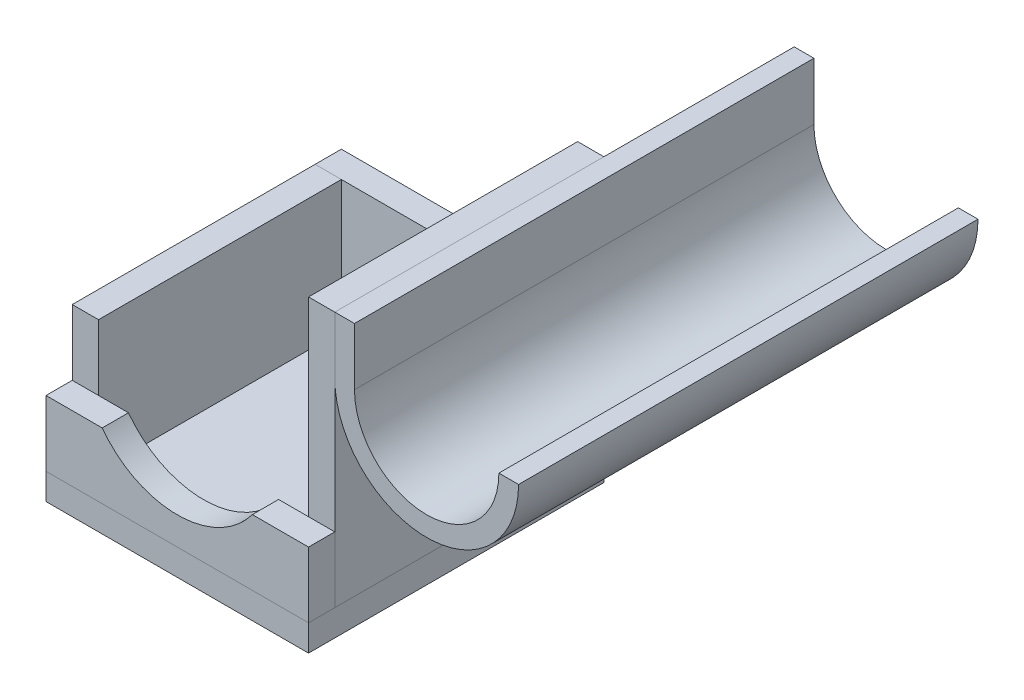
ISO-10303-21;
HEADER;
FILE_DESCRIPTION(('STEP AP214'),'2;1');
FILE_NAME('part.step','',(''),(''),'','','');
FILE_SCHEMA(('AUTOMOTIVE_DESIGN { 1 0 10303 214 1 1 1 1 }'));
ENDSEC;
DATA;
#1=APPLICATION_CONTEXT('core data for automotive mechanical design processes');
#2=APPLICATION_PROTOCOL_DEFINITION('international standard','automotive_design',2000,#1);
#3=PRODUCT_CONTEXT('',#1,'mechanical');
#4=PRODUCT('Part','Part','',(#3));
#5=PRODUCT_RELATED_PRODUCT_CATEGORY('part','',(#4));
#6=PRODUCT_DEFINITION_FORMATION('','',#4);
#7=PRODUCT_DEFINITION_CONTEXT('part definition',#1,'design');
#8=PRODUCT_DEFINITION('design','',#6,#7);
#9=PRODUCT_DEFINITION_SHAPE('','',#8);
#10=(LENGTH_UNIT() NAMED_UNIT(*) SI_UNIT(.MILLI.,.METRE.));
#11=(NAMED_UNIT(*) PLANE_ANGLE_UNIT() SI_UNIT($,.RADIAN.));
#12=(NAMED_UNIT(*) SI_UNIT($,.STERADIAN.) SOLID_ANGLE_UNIT());
#13=UNCERTAINTY_MEASURE_WITH_UNIT(LENGTH_MEASURE(1.E-05),#10,'distance_accuracy_value','');
#14=(GEOMETRIC_REPRESENTATION_CONTEXT(3) GLOBAL_UNCERTAINTY_ASSIGNED_CONTEXT((#13)) GLOBAL_UNIT_ASSIGNED_CONTEXT((#10,
#11,#12)) REPRESENTATION_CONTEXT('',''));
#15=CARTESIAN_POINT('',(0.,0.,0.));
#16=DIRECTION('',(0.,0.,1.));
#17=DIRECTION('',(1.,0.,0.));
#18=AXIS2_PLACEMENT_3D('',#15,#16,#17);
#19=CARTESIAN_POINT('',(54.0453432322365,46.4163242911228,57.6635956434258));
#20=DIRECTION('',(0.,0.,-1.));
#21=DIRECTION('',(-1.,0.,0.));
#22=AXIS2_PLACEMENT_3D('',#19,#20,#21);
#23=CYLINDRICAL_SURFACE('',#22,14.);
#24=CARTESIAN_POINT('',(54.0453432322365,46.4163242911228,57.6635956434258));
#25=DIRECTION('',(0.,0.,1.));
#26=DIRECTION('',(1.,0.,0.));
#27=AXIS2_PLACEMENT_3D('',#24,#25,#26);
#28=CIRCLE('',#27,14.);
#29=CARTESIAN_POINT('',(40.0453432322365,46.4163242911228,57.6635956434258));
#30=VERTEX_POINT('',#29);
#31=CARTESIAN_POINT('',(68.0453432322365,46.4163242911228,57.6635956434258));
#32=VERTEX_POINT('',#31);
#33=EDGE_CURVE('P0_E112',#30,#32,#28,.T.);
#34=ORIENTED_EDGE('',*,*,#33,.F.);
#35=DIRECTION('',(0.,0.,-1.));
#36=VECTOR('',#35,1.);
#37=CARTESIAN_POINT('',(40.0453432322365,46.4163242911228,57.6635956434258));
#38=LINE('',#37,#36);
#39=CARTESIAN_POINT('',(40.0453432322365,46.4163242911228,-12.3364043565742));
#40=VERTEX_POINT('',#39);
#41=EDGE_CURVE('P0_E104',#30,#40,#38,.T.);
#42=ORIENTED_EDGE('',*,*,#41,.T.);
#43=CARTESIAN_POINT('',(54.0453432322365,46.4163242911228,-12.3364043565742));
#44=DIRECTION('',(0.,0.,1.));
#45=DIRECTION('',(1.,0.,0.));
#46=AXIS2_PLACEMENT_3D('',#43,#44,#45);
#47=CIRCLE('',#46,14.);
#48=CARTESIAN_POINT('',(68.0453432322365,46.4163242911228,-12.3364043565742));
#49=VERTEX_POINT('',#48);
#50=EDGE_CURVE('P0_E87',#40,#49,#47,.T.);
#51=ORIENTED_EDGE('',*,*,#50,.T.);
#52=DIRECTION('',(0.,0.,-1.));
#53=VECTOR('',#52,1.);
#54=CARTESIAN_POINT('',(68.0453432322365,46.4163242911228,57.6635956434258));
#55=LINE('',#54,#53);
#56=EDGE_CURVE('P0_E34',#49,#32,#55,.F.);
#57=ORIENTED_EDGE('',*,*,#56,.T.);
#58=EDGE_LOOP('',(#34,#42,#51,#57));
#59=FACE_BOUND('',#58,.T.);
#60=ADVANCED_FACE('P0_F16',(#59),#23,.T.);
#61=CARTESIAN_POINT('',(54.0453432322365,46.4163242911228,57.6635956434258));
#62=DIRECTION('',(0.,0.,1.));
#63=DIRECTION('',(1.,0.,0.));
#64=AXIS2_PLACEMENT_3D('',#61,#62,#63);
#65=PLANE('',#64);
#66=CARTESIAN_POINT('',(54.0453432322365,46.4163242911228,57.6635956434258));
#67=DIRECTION('',(0.,0.,1.));
#68=DIRECTION('',(1.,0.,0.));
#69=AXIS2_PLACEMENT_3D('',#66,#67,#68);
#70=CIRCLE('',#69,11.);
#71=CARTESIAN_POINT('',(43.0453432322365,46.4163242911228,57.6635956434258));
#72=VERTEX_POINT('',#71);
#73=CARTESIAN_POINT('',(65.0453432322365,46.4163242911228,57.6635956434258));
#74=VERTEX_POINT('',#73);
#75=EDGE_CURVE('P0_E106',#72,#74,#70,.T.);
#76=ORIENTED_EDGE('',*,*,#75,.F.);
#77=DIRECTION('',(0.,1.,0.));
#78=VECTOR('',#77,1.);
#79=CARTESIAN_POINT('',(43.0453432322365,46.4163242911228,57.6635956434258));
#80=LINE('',#79,#78);
#81=CARTESIAN_POINT('',(43.0453432322365,55.1570933663999,57.6635956434258));
#82=VERTEX_POINT('',#81);
#83=EDGE_CURVE('P0_E90',#72,#82,#80,.T.);
#84=ORIENTED_EDGE('',*,*,#83,.T.);
#85=DIRECTION('',(-1.,0.,0.));
#86=VECTOR('',#85,1.);
#87=CARTESIAN_POINT('',(43.0453432322365,55.1570933663999,57.6635956434258));
#88=LINE('',#87,#86);
#89=CARTESIAN_POINT('',(40.0453432322365,55.1570933663999,57.6635956434258));
#90=VERTEX_POINT('',#89);
#91=EDGE_CURVE('P0_E96',#82,#90,#88,.T.);
#92=ORIENTED_EDGE('',*,*,#91,.T.);
#93=DIRECTION('',(0.,-1.,0.));
#94=VECTOR('',#93,1.);
#95=CARTESIAN_POINT('',(40.0453432322365,55.1570933663999,57.6635956434258));
#96=LINE('',#95,#94);
#97=EDGE_CURVE('P0_E71',#90,#30,#96,.T.);
#98=ORIENTED_EDGE('',*,*,#97,.T.);
#99=ORIENTED_EDGE('',*,*,#33,.T.);
#100=DIRECTION('',(1.,0.,0.));
#101=VECTOR('',#100,1.);
#102=CARTESIAN_POINT('',(38.0159749624971,46.4163242911228,57.6635956434258));
#103=LINE('',#102,#101);
#104=EDGE_CURVE('P0_E99',#74,#32,#103,.T.);
#105=ORIENTED_EDGE('',*,*,#104,.F.);
#106=EDGE_LOOP('',(#76,#84,#92,#98,#99,#105));
#107=FACE_BOUND('',#106,.T.);
#108=ADVANCED_FACE('P0_F123',(#107),#65,.T.);
#109=CARTESIAN_POINT('',(54.0453432322365,46.4163242911228,-12.3364043565742));
#110=DIRECTION('',(0.,0.,1.));
#111=DIRECTION('',(1.,0.,0.));
#112=AXIS2_PLACEMENT_3D('',#109,#110,#111);
#113=PLANE('',#112);
#114=ORIENTED_EDGE('',*,*,#50,.F.);
#115=DIRECTION('',(0.,-1.,0.));
#116=VECTOR('',#115,1.);
#117=CARTESIAN_POINT('',(40.0453432322365,55.1570933663999,-12.3364043565742));
#118=LINE('',#117,#116);
#119=CARTESIAN_POINT('',(40.0453432322365,55.1570933663999,-12.3364043565742));
#120=VERTEX_POINT('',#119);
#121=EDGE_CURVE('P0_E69',#120,#40,#118,.T.);
#122=ORIENTED_EDGE('',*,*,#121,.F.);
#123=DIRECTION('',(-1.,0.,0.));
#124=VECTOR('',#123,1.);
#125=CARTESIAN_POINT('',(43.0453432322365,55.1570933663999,-12.3364043565742));
#126=LINE('',#125,#124);
#127=CARTESIAN_POINT('',(43.0453432322365,55.1570933663999,-12.3364043565742));
#128=VERTEX_POINT('',#127);
#129=EDGE_CURVE('P0_E84',#128,#120,#126,.T.);
#130=ORIENTED_EDGE('',*,*,#129,.F.);
#131=DIRECTION('',(0.,1.,0.));
#132=VECTOR('',#131,1.);
#133=CARTESIAN_POINT('',(43.0453432322365,46.4163242911228,-12.3364043565742));
#134=LINE('',#133,#132);
#135=CARTESIAN_POINT('',(43.0453432322365,46.4163242911228,-12.3364043565742));
#136=VERTEX_POINT('',#135);
#137=EDGE_CURVE('P0_E77',#136,#128,#134,.T.);
#138=ORIENTED_EDGE('',*,*,#137,.F.);
#139=CARTESIAN_POINT('',(54.0453432322365,46.4163242911228,-12.3364043565742));
#140=DIRECTION('',(0.,0.,1.));
#141=DIRECTION('',(1.,0.,0.));
#142=AXIS2_PLACEMENT_3D('',#139,#140,#141);
#143=CIRCLE('',#142,11.);
#144=CARTESIAN_POINT('',(65.0453432322365,46.4163242911228,-12.3364043565742));
#145=VERTEX_POINT('',#144);
#146=EDGE_CURVE('P0_E107',#136,#145,#143,.T.);
#147=ORIENTED_EDGE('',*,*,#146,.T.);
#148=DIRECTION('',(1.,0.,0.));
#149=VECTOR('',#148,1.);
#150=CARTESIAN_POINT('',(38.0159749624971,46.4163242911228,-12.3364043565742));
#151=LINE('',#150,#149);
#152=EDGE_CURVE('P0_E30',#145,#49,#151,.T.);
#153=ORIENTED_EDGE('',*,*,#152,.T.);
#154=EDGE_LOOP('',(#114,#122,#130,#138,#147,#153));
#155=FACE_BOUND('',#154,.T.);
#156=ADVANCED_FACE('P0_F82',(#155),#113,.F.);
#157=CARTESIAN_POINT('',(54.0453432322365,46.4163242911228,-12.3364043565742));
#158=DIRECTION('',(0.,0.,1.));
#159=DIRECTION('',(1.,0.,0.));
#160=AXIS2_PLACEMENT_3D('',#157,#158,#159);
#161=CYLINDRICAL_SURFACE('',#160,11.);
#162=ORIENTED_EDGE('',*,*,#75,.T.);
#163=DIRECTION('',(0.,0.,1.));
#164=VECTOR('',#163,1.);
#165=CARTESIAN_POINT('',(65.0453432322365,46.4163242911228,-12.3364043565742));
#166=LINE('',#165,#164);
#167=EDGE_CURVE('P0_E10',#74,#145,#166,.F.);
#168=ORIENTED_EDGE('',*,*,#167,.T.);
#169=ORIENTED_EDGE('',*,*,#146,.F.);
#170=DIRECTION('',(0.,0.,1.));
#171=VECTOR('',#170,1.);
#172=CARTESIAN_POINT('',(43.0453432322365,46.4163242911228,-12.3364043565742));
#173=LINE('',#172,#171);
#174=EDGE_CURVE('P0_E23',#136,#72,#173,.T.);
#175=ORIENTED_EDGE('',*,*,#174,.T.);
#176=EDGE_LOOP('',(#162,#168,#169,#175));
#177=FACE_BOUND('',#176,.T.);
#178=ADVANCED_FACE('P0_F119',(#177),#161,.F.);
#179=CARTESIAN_POINT('',(38.0159749624971,46.4163242911228,-12.3364043565742));
#180=DIRECTION('',(0.,-1.,0.));
#181=DIRECTION('',(0.,0.,-1.));
#182=AXIS2_PLACEMENT_3D('',#179,#180,#181);
#183=PLANE('',#182);
#184=ORIENTED_EDGE('',*,*,#152,.F.);
#185=ORIENTED_EDGE('',*,*,#167,.F.);
#186=ORIENTED_EDGE('',*,*,#104,.T.);
#187=ORIENTED_EDGE('',*,*,#56,.F.);
#188=EDGE_LOOP('',(#184,#185,#186,#187));
#189=FACE_BOUND('',#188,.T.);
#190=ADVANCED_FACE('P0_F125',(#189),#183,.F.);
#191=CARTESIAN_POINT('',(43.0453432322365,55.1570933663999,-12.3364043565742));
#192=DIRECTION('',(0.,1.,0.));
#193=DIRECTION('',(0.,0.,1.));
#194=AXIS2_PLACEMENT_3D('',#191,#192,#193);
#195=PLANE('',#194);
#196=ORIENTED_EDGE('',*,*,#91,.F.);
#197=DIRECTION('',(0.,0.,1.));
#198=VECTOR('',#197,1.);
#199=CARTESIAN_POINT('',(43.0453432322365,55.1570933663999,-12.3364043565742));
#200=LINE('',#199,#198);
#201=EDGE_CURVE('P0_E76',#128,#82,#200,.T.);
#202=ORIENTED_EDGE('',*,*,#201,.F.);
#203=ORIENTED_EDGE('',*,*,#129,.T.);
#204=DIRECTION('',(0.,0.,1.));
#205=VECTOR('',#204,1.);
#206=CARTESIAN_POINT('',(40.0453432322365,55.1570933663999,-12.3364043565742));
#207=LINE('',#206,#205);
#208=EDGE_CURVE('P0_E65',#120,#90,#207,.T.);
#209=ORIENTED_EDGE('',*,*,#208,.T.);
#210=EDGE_LOOP('',(#196,#202,#203,#209));
#211=FACE_BOUND('',#210,.T.);
#212=ADVANCED_FACE('P0_F89',(#211),#195,.T.);
#213=CARTESIAN_POINT('',(43.0453432322365,46.4163242911228,-12.3364043565742));
#214=DIRECTION('',(1.,0.,0.));
#215=DIRECTION('',(0.,0.,-1.));
#216=AXIS2_PLACEMENT_3D('',#213,#214,#215);
#217=PLANE('',#216);
#218=ORIENTED_EDGE('',*,*,#83,.F.);
#219=ORIENTED_EDGE('',*,*,#174,.F.);
#220=ORIENTED_EDGE('',*,*,#137,.T.);
#221=ORIENTED_EDGE('',*,*,#201,.T.);
#222=EDGE_LOOP('',(#218,#219,#220,#221));
#223=FACE_BOUND('',#222,.T.);
#224=ADVANCED_FACE('P0_F121',(#223),#217,.T.);
#225=CARTESIAN_POINT('',(40.0453432322365,55.1570933663999,-12.3364043565742));
#226=DIRECTION('',(-1.,0.,0.));
#227=DIRECTION('',(0.,-1.,0.));
#228=AXIS2_PLACEMENT_3D('',#225,#226,#227);
#229=PLANE('',#228);
#230=ORIENTED_EDGE('',*,*,#97,.F.);
#231=ORIENTED_EDGE('',*,*,#208,.F.);
#232=ORIENTED_EDGE('',*,*,#121,.T.);
#233=ORIENTED_EDGE('',*,*,#41,.F.);
#234=EDGE_LOOP('',(#230,#231,#232,#233));
#235=FACE_BOUND('',#234,.T.);
#236=ADVANCED_FACE('P0_F67',(#235),#229,.T.);
#237=CLOSED_SHELL('',(#60,#108,#156,#178,#190,#212,#224,#236));
#238=MANIFOLD_SOLID_BREP('P0_B1',#237);
#239=CARTESIAN_POINT('',(30.0453432322365,36.1570933663999,20.6635956434258));
#240=DIRECTION('',(1.,0.,0.));
#241=DIRECTION('',(0.,1.,0.));
#242=AXIS2_PLACEMENT_3D('',#239,#240,#241);
#243=PLANE('',#242);
#244=DIRECTION('',(0.,-1.,0.));
#245=VECTOR('',#244,1.);
#246=CARTESIAN_POINT('',(30.0453432322365,36.1570933663999,16.6635956434258));
#247=LINE('',#246,#245);
#248=CARTESIAN_POINT('',(30.0453432322365,36.1570933663999,16.6635956434258));
#249=VERTEX_POINT('',#248);
#250=CARTESIAN_POINT('',(30.0453432322365,16.1570933663999,16.6635956434258));
#251=VERTEX_POINT('',#250);
#252=EDGE_CURVE('P1_E81',#249,#251,#247,.T.);
#253=ORIENTED_EDGE('',*,*,#252,.F.);
#254=DIRECTION('',(0.,0.,-1.));
#255=VECTOR('',#254,1.);
#256=CARTESIAN_POINT('',(30.0453432322365,36.1570933663999,20.6635956434258));
#257=LINE('',#256,#255);
#258=CARTESIAN_POINT('',(30.0453432322365,36.1570933663999,20.6635956434258));
#259=VERTEX_POINT('',#258);
#260=EDGE_CURVE('P1_E11',#259,#249,#257,.T.);
#261=ORIENTED_EDGE('',*,*,#260,.F.);
#262=DIRECTION('',(0.,-1.,0.));
#263=VECTOR('',#262,1.);
#264=CARTESIAN_POINT('',(30.0453432322365,36.1570933663999,20.6635956434258));
#265=LINE('',#264,#263);
#266=CARTESIAN_POINT('',(30.0453432322365,16.1570933663999,20.6635956434258));
#267=VERTEX_POINT('',#266);
#268=EDGE_CURVE('P1_E75',#259,#267,#265,.T.);
#269=ORIENTED_EDGE('',*,*,#268,.T.);
#270=DIRECTION('',(0.,0.,-1.));
#271=VECTOR('',#270,1.);
#272=CARTESIAN_POINT('',(30.0453432322365,16.1570933663999,20.6635956434258));
#273=LINE('',#272,#271);
#274=EDGE_CURVE('P1_E20',#267,#251,#273,.T.);
#275=ORIENTED_EDGE('',*,*,#274,.T.);
#276=EDGE_LOOP('',(#253,#261,#269,#275));
#277=FACE_BOUND('',#276,.T.);
#278=ADVANCED_FACE('P1_F17',(#277),#243,.T.);
#279=CARTESIAN_POINT('',(0.0453432322364763,36.1570933663999,20.6635956434258));
#280=DIRECTION('',(0.,1.,0.));
#281=DIRECTION('',(0.,0.,1.));
#282=AXIS2_PLACEMENT_3D('',#279,#280,#281);
#283=PLANE('',#282);
#284=DIRECTION('',(1.,0.,0.));
#285=VECTOR('',#284,1.);
#286=CARTESIAN_POINT('',(0.0453432322364763,36.1570933663999,16.6635956434258));
#287=LINE('',#286,#285);
#288=CARTESIAN_POINT('',(0.0453432322364763,36.1570933663999,16.6635956434258));
#289=VERTEX_POINT('',#288);
#290=EDGE_CURVE('P1_E77',#289,#249,#287,.T.);
#291=ORIENTED_EDGE('',*,*,#290,.F.);
#292=DIRECTION('',(0.,0.,-1.));
#293=VECTOR('',#292,1.);
#294=CARTESIAN_POINT('',(0.0453432322364763,36.1570933663999,20.6635956434258));
#295=LINE('',#294,#293);
#296=CARTESIAN_POINT('',(0.0453432322364763,36.1570933663999,20.6635956434258));
#297=VERTEX_POINT('',#296);
#298=EDGE_CURVE('P1_E26',#297,#289,#295,.T.);
#299=ORIENTED_EDGE('',*,*,#298,.F.);
#300=DIRECTION('',(1.,0.,0.));
#301=VECTOR('',#300,1.);
#302=CARTESIAN_POINT('',(0.0453432322364763,36.1570933663999,20.6635956434258));
#303=LINE('',#302,#301);
#304=EDGE_CURVE('P1_E72',#297,#259,#303,.T.);
#305=ORIENTED_EDGE('',*,*,#304,.T.);
#306=ORIENTED_EDGE('',*,*,#260,.T.);
#307=EDGE_LOOP('',(#291,#299,#305,#306));
#308=FACE_BOUND('',#307,.T.);
#309=ADVANCED_FACE('P1_F91',(#308),#283,.T.);
#310=CARTESIAN_POINT('',(0.0453432322364729,16.1570933663999,20.6635956434258));
#311=DIRECTION('',(-1.,0.,0.));
#312=DIRECTION('',(0.,-1.,0.));
#313=AXIS2_PLACEMENT_3D('',#310,#311,#312);
#314=PLANE('',#313);
#315=DIRECTION('',(0.,1.,0.));
#316=VECTOR('',#315,1.);
#317=CARTESIAN_POINT('',(0.0453432322364729,16.1570933663999,16.6635956434258));
#318=LINE('',#317,#316);
#319=CARTESIAN_POINT('',(0.0453432322364729,16.1570933663999,16.6635956434258));
#320=VERTEX_POINT('',#319);
#321=EDGE_CURVE('P1_E67',#320,#289,#318,.T.);
#322=ORIENTED_EDGE('',*,*,#321,.F.);
#323=DIRECTION('',(0.,0.,-1.));
#324=VECTOR('',#323,1.);
#325=CARTESIAN_POINT('',(0.0453432322364729,16.1570933663999,20.6635956434258));
#326=LINE('',#325,#324);
#327=CARTESIAN_POINT('',(0.0453432322364729,16.1570933663999,20.6635956434258));
#328=VERTEX_POINT('',#327);
#329=EDGE_CURVE('P1_E62',#328,#320,#326,.T.);
#330=ORIENTED_EDGE('',*,*,#329,.F.);
#331=DIRECTION('',(0.,1.,0.));
#332=VECTOR('',#331,1.);
#333=CARTESIAN_POINT('',(0.0453432322364729,16.1570933663999,20.6635956434258));
#334=LINE('',#333,#332);
#335=EDGE_CURVE('P1_E65',#328,#297,#334,.T.);
#336=ORIENTED_EDGE('',*,*,#335,.T.);
#337=ORIENTED_EDGE('',*,*,#298,.T.);
#338=EDGE_LOOP('',(#322,#330,#336,#337));
#339=FACE_BOUND('',#338,.T.);
#340=ADVANCED_FACE('P1_F64',(#339),#314,.T.);
#341=CARTESIAN_POINT('',(30.0453432322365,16.1570933663999,20.6635956434258));
#342=DIRECTION('',(0.,-1.,0.));
#343=DIRECTION('',(0.,0.,-1.));
#344=AXIS2_PLACEMENT_3D('',#341,#342,#343);
#345=PLANE('',#344);
#346=DIRECTION('',(-1.,0.,0.));
#347=VECTOR('',#346,1.);
#348=CARTESIAN_POINT('',(30.0453432322365,16.1570933663999,16.6635956434258));
#349=LINE('',#348,#347);
#350=EDGE_CURVE('P1_E84',#251,#320,#349,.T.);
#351=ORIENTED_EDGE('',*,*,#350,.F.);
#352=ORIENTED_EDGE('',*,*,#274,.F.);
#353=DIRECTION('',(-1.,0.,0.));
#354=VECTOR('',#353,1.);
#355=CARTESIAN_POINT('',(30.0453432322365,16.1570933663999,20.6635956434258));
#356=LINE('',#355,#354);
#357=EDGE_CURVE('P1_E71',#267,#328,#356,.T.);
#358=ORIENTED_EDGE('',*,*,#357,.T.);
#359=ORIENTED_EDGE('',*,*,#329,.T.);
#360=EDGE_LOOP('',(#351,#352,#358,#359));
#361=FACE_BOUND('',#360,.T.);
#362=ADVANCED_FACE('P1_F74',(#361),#345,.T.);
#363=CARTESIAN_POINT('',(0.0453432322364729,16.1570933663999,20.6635956434258));
#364=DIRECTION('',(0.,0.,-1.));
#365=DIRECTION('',(-1.,0.,0.));
#366=AXIS2_PLACEMENT_3D('',#363,#364,#365);
#367=PLANE('',#366);
#368=ORIENTED_EDGE('',*,*,#268,.F.);
#369=ORIENTED_EDGE('',*,*,#304,.F.);
#370=ORIENTED_EDGE('',*,*,#335,.F.);
#371=ORIENTED_EDGE('',*,*,#357,.F.);
#372=EDGE_LOOP('',(#368,#369,#370,#371));
#373=FACE_BOUND('',#372,.T.);
#374=ADVANCED_FACE('P1_F70',(#373),#367,.F.);
#375=CARTESIAN_POINT('',(0.0453432322364729,16.1570933663999,16.6635956434258));
#376=DIRECTION('',(0.,0.,-1.));
#377=DIRECTION('',(-1.,0.,0.));
#378=AXIS2_PLACEMENT_3D('',#375,#376,#377);
#379=PLANE('',#378);
#380=ORIENTED_EDGE('',*,*,#252,.T.);
#381=ORIENTED_EDGE('',*,*,#350,.T.);
#382=ORIENTED_EDGE('',*,*,#321,.T.);
#383=ORIENTED_EDGE('',*,*,#290,.T.);
#384=EDGE_LOOP('',(#380,#381,#382,#383));
#385=FACE_BOUND('',#384,.T.);
#386=ADVANCED_FACE('P1_F90',(#385),#379,.T.);
#387=CLOSED_SHELL('',(#278,#309,#340,#362,#374,#386));
#388=MANIFOLD_SOLID_BREP('P1_B1',#387);
#389=CARTESIAN_POINT('',(40.0453432322365,26.1570933663999,61.6635956434258));
#390=DIRECTION('',(0.,-1.,0.));
#391=DIRECTION('',(0.,0.,-1.));
#392=AXIS2_PLACEMENT_3D('',#389,#390,#391);
#393=PLANE('',#392);
#394=DIRECTION('',(-1.,0.,0.));
#395=VECTOR('',#394,1.);
#396=CARTESIAN_POINT('',(40.0453432322365,26.1570933663999,57.6635956434258));
#397=LINE('',#396,#395);
#398=CARTESIAN_POINT('',(40.0453432322365,26.1570933663999,57.6635956434258));
#399=VERTEX_POINT('',#398);
#400=CARTESIAN_POINT('',(31.4826724659343,26.1570933663999,57.6635956434258));
#401=VERTEX_POINT('',#400);
#402=EDGE_CURVE('P2_E95',#399,#401,#397,.T.);
#403=ORIENTED_EDGE('',*,*,#402,.T.);
#404=DIRECTION('',(0.,0.,1.));
#405=VECTOR('',#404,1.);
#406=CARTESIAN_POINT('',(31.4826724659343,26.1570933663999,57.6635956434258));
#407=LINE('',#406,#405);
#408=CARTESIAN_POINT('',(31.4826724659343,26.1570933663999,61.6635956434258));
#409=VERTEX_POINT('',#408);
#410=EDGE_CURVE('P2_E32',#401,#409,#407,.T.);
#411=ORIENTED_EDGE('',*,*,#410,.T.);
#412=DIRECTION('',(-1.,0.,0.));
#413=VECTOR('',#412,1.);
#414=CARTESIAN_POINT('',(40.0453432322365,26.1570933663999,61.6635956434258));
#415=LINE('',#414,#413);
#416=CARTESIAN_POINT('',(40.0453432322365,26.1570933663999,61.6635956434258));
#417=VERTEX_POINT('',#416);
#418=EDGE_CURVE('P2_E118',#417,#409,#415,.T.);
#419=ORIENTED_EDGE('',*,*,#418,.F.);
#420=DIRECTION('',(0.,0.,-1.));
#421=VECTOR('',#420,1.);
#422=CARTESIAN_POINT('',(40.0453432322365,26.1570933663999,61.6635956434258));
#423=LINE('',#422,#421);
#424=EDGE_CURVE('P2_E105',#417,#399,#423,.T.);
#425=ORIENTED_EDGE('',*,*,#424,.T.);
#426=EDGE_LOOP('',(#403,#411,#419,#425));
#427=FACE_BOUND('',#426,.T.);
#428=ADVANCED_FACE('P2_F17',(#427),#393,.F.);
#429=CARTESIAN_POINT('',(8.6080139985386,26.1570933663999,61.6635956434258));
#430=VERTEX_POINT('',#429);
#431=CARTESIAN_POINT('',(0.0453432322364729,26.1570933663999,61.6635956434258));
#432=VERTEX_POINT('',#431);
#433=EDGE_CURVE('P2_E69',#430,#432,#415,.T.);
#434=ORIENTED_EDGE('',*,*,#433,.F.);
#435=DIRECTION('',(0.,0.,1.));
#436=VECTOR('',#435,1.);
#437=CARTESIAN_POINT('',(8.6080139985386,26.1570933663999,57.6635956434258));
#438=LINE('',#437,#436);
#439=CARTESIAN_POINT('',(8.6080139985386,26.1570933663999,57.6635956434258));
#440=VERTEX_POINT('',#439);
#441=EDGE_CURVE('P2_E80',#430,#440,#438,.F.);
#442=ORIENTED_EDGE('',*,*,#441,.T.);
#443=CARTESIAN_POINT('',(0.0453432322364729,26.1570933663999,57.6635956434258));
#444=VERTEX_POINT('',#443);
#445=EDGE_CURVE('P2_E89',#440,#444,#397,.T.);
#446=ORIENTED_EDGE('',*,*,#445,.T.);
#447=DIRECTION('',(0.,0.,-1.));
#448=VECTOR('',#447,1.);
#449=CARTESIAN_POINT('',(0.0453432322364729,26.1570933663999,61.6635956434258));
#450=LINE('',#449,#448);
#451=EDGE_CURVE('P2_E11',#432,#444,#450,.T.);
#452=ORIENTED_EDGE('',*,*,#451,.F.);
#453=EDGE_LOOP('',(#434,#442,#446,#452));
#454=FACE_BOUND('',#453,.T.);
#455=ADVANCED_FACE('P2_F19',(#454),#393,.F.);
#456=CARTESIAN_POINT('',(0.0453432322364729,26.1570933663999,61.6635956434258));
#457=DIRECTION('',(1.,0.,0.));
#458=DIRECTION('',(0.,0.,-1.));
#459=AXIS2_PLACEMENT_3D('',#456,#457,#458);
#460=PLANE('',#459);
#461=DIRECTION('',(0.,-1.,0.));
#462=VECTOR('',#461,1.);
#463=CARTESIAN_POINT('',(0.0453432322364729,26.1570933663999,57.6635956434258));
#464=LINE('',#463,#462);
#465=CARTESIAN_POINT('',(0.0453432322364729,16.1570933663999,57.6635956434258));
#466=VERTEX_POINT('',#465);
#467=EDGE_CURVE('P2_E94',#444,#466,#464,.T.);
#468=ORIENTED_EDGE('',*,*,#467,.T.);
#469=DIRECTION('',(0.,0.,-1.));
#470=VECTOR('',#469,1.);
#471=CARTESIAN_POINT('',(0.0453432322364729,16.1570933663999,61.6635956434258));
#472=LINE('',#471,#470);
#473=CARTESIAN_POINT('',(0.0453432322364729,16.1570933663999,61.6635956434258));
#474=VERTEX_POINT('',#473);
#475=EDGE_CURVE('P2_E25',#474,#466,#472,.T.);
#476=ORIENTED_EDGE('',*,*,#475,.F.);
#477=DIRECTION('',(0.,-1.,0.));
#478=VECTOR('',#477,1.);
#479=CARTESIAN_POINT('',(0.0453432322364729,26.1570933663999,61.6635956434258));
#480=LINE('',#479,#478);
#481=EDGE_CURVE('P2_E120',#432,#474,#480,.T.);
#482=ORIENTED_EDGE('',*,*,#481,.F.);
#483=ORIENTED_EDGE('',*,*,#451,.T.);
#484=EDGE_LOOP('',(#468,#476,#482,#483));
#485=FACE_BOUND('',#484,.T.);
#486=ADVANCED_FACE('P2_F139',(#485),#460,.F.);
#487=CARTESIAN_POINT('',(0.0453432322364729,16.1570933663999,61.6635956434258));
#488=DIRECTION('',(0.,1.,0.));
#489=DIRECTION('',(0.,0.,1.));
#490=AXIS2_PLACEMENT_3D('',#487,#488,#489);
#491=PLANE('',#490);
#492=DIRECTION('',(1.,0.,0.));
#493=VECTOR('',#492,1.);
#494=CARTESIAN_POINT('',(0.0453432322364729,16.1570933663999,57.6635956434258));
#495=LINE('',#494,#493);
#496=CARTESIAN_POINT('',(40.0453432322365,16.1570933663999,57.6635956434258));
#497=VERTEX_POINT('',#496);
#498=EDGE_CURVE('P2_E102',#466,#497,#495,.T.);
#499=ORIENTED_EDGE('',*,*,#498,.T.);
#500=DIRECTION('',(0.,0.,-1.));
#501=VECTOR('',#500,1.);
#502=CARTESIAN_POINT('',(40.0453432322365,16.1570933663999,61.6635956434258));
#503=LINE('',#502,#501);
#504=CARTESIAN_POINT('',(40.0453432322365,16.1570933663999,61.6635956434258));
#505=VERTEX_POINT('',#504);
#506=EDGE_CURVE('P2_E107',#505,#497,#503,.T.);
#507=ORIENTED_EDGE('',*,*,#506,.F.);
#508=DIRECTION('',(1.,0.,0.));
#509=VECTOR('',#508,1.);
#510=CARTESIAN_POINT('',(0.0453432322364729,16.1570933663999,61.6635956434258));
#511=LINE('',#510,#509);
#512=EDGE_CURVE('P2_E114',#474,#505,#511,.T.);
#513=ORIENTED_EDGE('',*,*,#512,.F.);
#514=ORIENTED_EDGE('',*,*,#475,.T.);
#515=EDGE_LOOP('',(#499,#507,#513,#514));
#516=FACE_BOUND('',#515,.T.);
#517=ADVANCED_FACE('P2_F112',(#516),#491,.F.);
#518=CARTESIAN_POINT('',(40.0453432322365,16.1570933663999,61.6635956434258));
#519=DIRECTION('',(-1.,0.,0.));
#520=DIRECTION('',(0.,0.,1.));
#521=AXIS2_PLACEMENT_3D('',#518,#519,#520);
#522=PLANE('',#521);
#523=DIRECTION('',(0.,1.,0.));
#524=VECTOR('',#523,1.);
#525=CARTESIAN_POINT('',(40.0453432322365,16.1570933663999,57.6635956434258));
#526=LINE('',#525,#524);
#527=EDGE_CURVE('P2_E62',#497,#399,#526,.T.);
#528=ORIENTED_EDGE('',*,*,#527,.T.);
#529=ORIENTED_EDGE('',*,*,#424,.F.);
#530=DIRECTION('',(0.,1.,0.));
#531=VECTOR('',#530,1.);
#532=CARTESIAN_POINT('',(40.0453432322365,16.1570933663999,61.6635956434258));
#533=LINE('',#532,#531);
#534=EDGE_CURVE('P2_E41',#505,#417,#533,.T.);
#535=ORIENTED_EDGE('',*,*,#534,.F.);
#536=ORIENTED_EDGE('',*,*,#506,.T.);
#537=EDGE_LOOP('',(#528,#529,#535,#536));
#538=FACE_BOUND('',#537,.T.);
#539=ADVANCED_FACE('P2_F119',(#538),#522,.F.);
#540=CARTESIAN_POINT('',(0.0453432322364729,16.1570933663999,61.6635956434258));
#541=DIRECTION('',(0.,0.,1.));
#542=DIRECTION('',(1.,0.,0.));
#543=AXIS2_PLACEMENT_3D('',#540,#541,#542);
#544=PLANE('',#543);
#545=CARTESIAN_POINT('',(20.0453432322365,34.6570933663999,61.6635956434258));
#546=DIRECTION('',(0.,0.,1.));
#547=DIRECTION('',(1.,0.,0.));
#548=AXIS2_PLACEMENT_3D('',#545,#546,#547);
#549=CIRCLE('',#548,14.25);
#550=EDGE_CURVE('P2_E85',#430,#409,#549,.T.);
#551=ORIENTED_EDGE('',*,*,#550,.F.);
#552=ORIENTED_EDGE('',*,*,#433,.T.);
#553=ORIENTED_EDGE('',*,*,#481,.T.);
#554=ORIENTED_EDGE('',*,*,#512,.T.);
#555=ORIENTED_EDGE('',*,*,#534,.T.);
#556=ORIENTED_EDGE('',*,*,#418,.T.);
#557=EDGE_LOOP('',(#551,#552,#553,#554,#555,#556));
#558=FACE_BOUND('',#557,.T.);
#559=ADVANCED_FACE('P2_F124',(#558),#544,.T.);
#560=CARTESIAN_POINT('',(0.0453432322364729,16.1570933663999,57.6635956434258));
#561=DIRECTION('',(0.,0.,1.));
#562=DIRECTION('',(1.,0.,0.));
#563=AXIS2_PLACEMENT_3D('',#560,#561,#562);
#564=PLANE('',#563);
#565=ORIENTED_EDGE('',*,*,#445,.F.);
#566=CARTESIAN_POINT('',(20.0453432322365,34.6570933663999,57.6635956434258));
#567=DIRECTION('',(0.,0.,1.));
#568=DIRECTION('',(1.,0.,0.));
#569=AXIS2_PLACEMENT_3D('',#566,#567,#568);
#570=CIRCLE('',#569,14.25);
#571=EDGE_CURVE('P2_E77',#440,#401,#570,.T.);
#572=ORIENTED_EDGE('',*,*,#571,.T.);
#573=ORIENTED_EDGE('',*,*,#402,.F.);
#574=ORIENTED_EDGE('',*,*,#527,.F.);
#575=ORIENTED_EDGE('',*,*,#498,.F.);
#576=ORIENTED_EDGE('',*,*,#467,.F.);
#577=EDGE_LOOP('',(#565,#572,#573,#574,#575,#576));
#578=FACE_BOUND('',#577,.T.);
#579=ADVANCED_FACE('P2_F92',(#578),#564,.F.);
#580=CARTESIAN_POINT('',(20.0453432322365,34.6570933663999,57.6635956434258));
#581=DIRECTION('',(0.,0.,1.));
#582=DIRECTION('',(1.,0.,0.));
#583=AXIS2_PLACEMENT_3D('',#580,#581,#582);
#584=CYLINDRICAL_SURFACE('',#583,14.25);
#585=ORIENTED_EDGE('',*,*,#571,.F.);
#586=ORIENTED_EDGE('',*,*,#441,.F.);
#587=ORIENTED_EDGE('',*,*,#550,.T.);
#588=ORIENTED_EDGE('',*,*,#410,.F.);
#589=EDGE_LOOP('',(#585,#586,#587,#588));
#590=FACE_BOUND('',#589,.T.);
#591=ADVANCED_FACE('P2_F79',(#590),#584,.F.);
#592=CLOSED_SHELL('',(#428,#455,#486,#517,#539,#559,#579,#591));
#593=MANIFOLD_SOLID_BREP('P2_B1',#592);
#594=CARTESIAN_POINT('',(40.0453432322365,55.1570933663999,16.6635956434258));
#595=DIRECTION('',(0.,0.,-1.));
#596=DIRECTION('',(0.,1.,0.));
#597=AXIS2_PLACEMENT_3D('',#594,#595,#596);
#598=PLANE('',#597);
#599=DIRECTION('',(0.,-1.,0.));
#600=VECTOR('',#599,1.);
#601=CARTESIAN_POINT('',(36.0453432322365,55.1570933663999,16.6635956434258));
#602=LINE('',#601,#600);
#603=CARTESIAN_POINT('',(36.0453432322365,55.1570933663999,16.6635956434258));
#604=VERTEX_POINT('',#603);
#605=CARTESIAN_POINT('',(36.0453432322365,16.1570933663999,16.6635956434258));
#606=VERTEX_POINT('',#605);
#607=EDGE_CURVE('P3_E81',#604,#606,#602,.T.);
#608=ORIENTED_EDGE('',*,*,#607,.F.);
#609=DIRECTION('',(-1.,0.,0.));
#610=VECTOR('',#609,1.);
#611=CARTESIAN_POINT('',(40.0453432322365,55.1570933663999,16.6635956434258));
#612=LINE('',#611,#610);
#613=CARTESIAN_POINT('',(40.0453432322365,55.1570933663999,16.6635956434258));
#614=VERTEX_POINT('',#613);
#615=EDGE_CURVE('P3_E11',#614,#604,#612,.T.);
#616=ORIENTED_EDGE('',*,*,#615,.F.);
#617=DIRECTION('',(0.,-1.,0.));
#618=VECTOR('',#617,1.);
#619=CARTESIAN_POINT('',(40.0453432322365,55.1570933663999,16.6635956434258));
#620=LINE('',#619,#618);
#621=CARTESIAN_POINT('',(40.0453432322365,16.1570933663999,16.6635956434258));
#622=VERTEX_POINT('',#621);
#623=EDGE_CURVE('P3_E75',#614,#622,#620,.T.);
#624=ORIENTED_EDGE('',*,*,#623,.T.);
#625=DIRECTION('',(-1.,0.,0.));
#626=VECTOR('',#625,1.);
#627=CARTESIAN_POINT('',(40.0453432322365,16.1570933663999,16.6635956434258));
#628=LINE('',#627,#626);
#629=EDGE_CURVE('P3_E20',#622,#606,#628,.T.);
#630=ORIENTED_EDGE('',*,*,#629,.T.);
#631=EDGE_LOOP('',(#608,#616,#624,#630));
#632=FACE_BOUND('',#631,.T.);
#633=ADVANCED_FACE('P3_F17',(#632),#598,.T.);
#634=CARTESIAN_POINT('',(40.0453432322365,55.1570933663999,57.6635956434258));
#635=DIRECTION('',(0.,1.,0.));
#636=DIRECTION('',(0.,0.,1.));
#637=AXIS2_PLACEMENT_3D('',#634,#635,#636);
#638=PLANE('',#637);
#639=DIRECTION('',(0.,0.,-1.));
#640=VECTOR('',#639,1.);
#641=CARTESIAN_POINT('',(36.0453432322365,55.1570933663999,57.6635956434258));
#642=LINE('',#641,#640);
#643=CARTESIAN_POINT('',(36.0453432322365,55.1570933663999,57.6635956434258));
#644=VERTEX_POINT('',#643);
#645=EDGE_CURVE('P3_E77',#644,#604,#642,.T.);
#646=ORIENTED_EDGE('',*,*,#645,.F.);
#647=DIRECTION('',(-1.,0.,0.));
#648=VECTOR('',#647,1.);
#649=CARTESIAN_POINT('',(40.0453432322365,55.1570933663999,57.6635956434258));
#650=LINE('',#649,#648);
#651=CARTESIAN_POINT('',(40.0453432322365,55.1570933663999,57.6635956434258));
#652=VERTEX_POINT('',#651);
#653=EDGE_CURVE('P3_E26',#652,#644,#650,.T.);
#654=ORIENTED_EDGE('',*,*,#653,.F.);
#655=DIRECTION('',(0.,0.,-1.));
#656=VECTOR('',#655,1.);
#657=CARTESIAN_POINT('',(40.0453432322365,55.1570933663999,57.6635956434258));
#658=LINE('',#657,#656);
#659=EDGE_CURVE('P3_E72',#652,#614,#658,.T.);
#660=ORIENTED_EDGE('',*,*,#659,.T.);
#661=ORIENTED_EDGE('',*,*,#615,.T.);
#662=EDGE_LOOP('',(#646,#654,#660,#661));
#663=FACE_BOUND('',#662,.T.);
#664=ADVANCED_FACE('P3_F91',(#663),#638,.T.);
#665=CARTESIAN_POINT('',(40.0453432322365,16.1570933663999,57.6635956434258));
#666=DIRECTION('',(0.,0.,1.));
#667=DIRECTION('',(0.,-1.,0.));
#668=AXIS2_PLACEMENT_3D('',#665,#666,#667);
#669=PLANE('',#668);
#670=DIRECTION('',(0.,1.,0.));
#671=VECTOR('',#670,1.);
#672=CARTESIAN_POINT('',(36.0453432322365,16.1570933663999,57.6635956434258));
#673=LINE('',#672,#671);
#674=CARTESIAN_POINT('',(36.0453432322365,16.1570933663999,57.6635956434258));
#675=VERTEX_POINT('',#674);
#676=EDGE_CURVE('P3_E67',#675,#644,#673,.T.);
#677=ORIENTED_EDGE('',*,*,#676,.F.);
#678=DIRECTION('',(-1.,0.,0.));
#679=VECTOR('',#678,1.);
#680=CARTESIAN_POINT('',(40.0453432322365,16.1570933663999,57.6635956434258));
#681=LINE('',#680,#679);
#682=CARTESIAN_POINT('',(40.0453432322365,16.1570933663999,57.6635956434258));
#683=VERTEX_POINT('',#682);
#684=EDGE_CURVE('P3_E62',#683,#675,#681,.T.);
#685=ORIENTED_EDGE('',*,*,#684,.F.);
#686=DIRECTION('',(0.,1.,0.));
#687=VECTOR('',#686,1.);
#688=CARTESIAN_POINT('',(40.0453432322365,16.1570933663999,57.6635956434258));
#689=LINE('',#688,#687);
#690=EDGE_CURVE('P3_E65',#683,#652,#689,.T.);
#691=ORIENTED_EDGE('',*,*,#690,.T.);
#692=ORIENTED_EDGE('',*,*,#653,.T.);
#693=EDGE_LOOP('',(#677,#685,#691,#692));
#694=FACE_BOUND('',#693,.T.);
#695=ADVANCED_FACE('P3_F64',(#694),#669,.T.);
#696=CARTESIAN_POINT('',(40.0453432322365,16.1570933663999,16.6635956434258));
#697=DIRECTION('',(0.,-1.,0.));
#698=DIRECTION('',(0.,0.,-1.));
#699=AXIS2_PLACEMENT_3D('',#696,#697,#698);
#700=PLANE('',#699);
#701=DIRECTION('',(0.,0.,1.));
#702=VECTOR('',#701,1.);
#703=CARTESIAN_POINT('',(36.0453432322365,16.1570933663999,16.6635956434258));
#704=LINE('',#703,#702);
#705=EDGE_CURVE('P3_E84',#606,#675,#704,.T.);
#706=ORIENTED_EDGE('',*,*,#705,.F.);
#707=ORIENTED_EDGE('',*,*,#629,.F.);
#708=DIRECTION('',(0.,0.,1.));
#709=VECTOR('',#708,1.);
#710=CARTESIAN_POINT('',(40.0453432322365,16.1570933663999,16.6635956434258));
#711=LINE('',#710,#709);
#712=EDGE_CURVE('P3_E71',#622,#683,#711,.T.);
#713=ORIENTED_EDGE('',*,*,#712,.T.);
#714=ORIENTED_EDGE('',*,*,#684,.T.);
#715=EDGE_LOOP('',(#706,#707,#713,#714));
#716=FACE_BOUND('',#715,.T.);
#717=ADVANCED_FACE('P3_F74',(#716),#700,.T.);
#718=CARTESIAN_POINT('',(40.0453432322365,16.1570933663999,57.6635956434258));
#719=DIRECTION('',(-1.,0.,0.));
#720=DIRECTION('',(0.,0.,1.));
#721=AXIS2_PLACEMENT_3D('',#718,#719,#720);
#722=PLANE('',#721);
#723=ORIENTED_EDGE('',*,*,#623,.F.);
#724=ORIENTED_EDGE('',*,*,#659,.F.);
#725=ORIENTED_EDGE('',*,*,#690,.F.);
#726=ORIENTED_EDGE('',*,*,#712,.F.);
#727=EDGE_LOOP('',(#723,#724,#725,#726));
#728=FACE_BOUND('',#727,.T.);
#729=ADVANCED_FACE('P3_F70',(#728),#722,.F.);
#730=CARTESIAN_POINT('',(36.0453432322365,16.1570933663999,57.6635956434258));
#731=DIRECTION('',(-1.,0.,0.));
#732=DIRECTION('',(0.,0.,1.));
#733=AXIS2_PLACEMENT_3D('',#730,#731,#732);
#734=PLANE('',#733);
#735=ORIENTED_EDGE('',*,*,#607,.T.);
#736=ORIENTED_EDGE('',*,*,#705,.T.);
#737=ORIENTED_EDGE('',*,*,#676,.T.);
#738=ORIENTED_EDGE('',*,*,#645,.T.);
#739=EDGE_LOOP('',(#735,#736,#737,#738));
#740=FACE_BOUND('',#739,.T.);
#741=ADVANCED_FACE('P3_F90',(#740),#734,.T.);
#742=CLOSED_SHELL('',(#633,#664,#695,#717,#729,#741));
#743=MANIFOLD_SOLID_BREP('P3_B1',#742);
#744=CARTESIAN_POINT('',(40.0453432322365,16.1570933663999,61.6635956434258));
#745=DIRECTION('',(0.,0.,-1.));
#746=DIRECTION('',(-1.,0.,0.));
#747=AXIS2_PLACEMENT_3D('',#744,#745,#746);
#748=PLANE('',#747);
#749=DIRECTION('',(1.,0.,0.));
#750=VECTOR('',#749,1.);
#751=CARTESIAN_POINT('',(40.0453432322365,12.1570933663999,61.6635956434258));
#752=LINE('',#751,#750);
#753=CARTESIAN_POINT('',(0.0453432322364729,12.1570933663999,61.6635956434258));
#754=VERTEX_POINT('',#753);
#755=CARTESIAN_POINT('',(40.0453432322365,12.1570933663999,61.6635956434258));
#756=VERTEX_POINT('',#755);
#757=EDGE_CURVE('P4_E80',#754,#756,#752,.T.);
#758=ORIENTED_EDGE('',*,*,#757,.T.);
#759=DIRECTION('',(0.,-1.,0.));
#760=VECTOR('',#759,1.);
#761=CARTESIAN_POINT('',(40.0453432322365,16.1570933663999,61.6635956434258));
#762=LINE('',#761,#760);
#763=CARTESIAN_POINT('',(40.0453432322365,16.1570933663999,61.6635956434258));
#764=VERTEX_POINT('',#763);
#765=EDGE_CURVE('P4_E11',#764,#756,#762,.T.);
#766=ORIENTED_EDGE('',*,*,#765,.F.);
#767=DIRECTION('',(1.,0.,0.));
#768=VECTOR('',#767,1.);
#769=CARTESIAN_POINT('',(40.0453432322365,16.1570933663999,61.6635956434258));
#770=LINE('',#769,#768);
#771=CARTESIAN_POINT('',(0.0453432322364729,16.1570933663999,61.6635956434258));
#772=VERTEX_POINT('',#771);
#773=EDGE_CURVE('P4_E68',#772,#764,#770,.T.);
#774=ORIENTED_EDGE('',*,*,#773,.F.);
#775=DIRECTION('',(0.,-1.,0.));
#776=VECTOR('',#775,1.);
#777=CARTESIAN_POINT('',(0.0453432322364729,16.1570933663999,61.6635956434258));
#778=LINE('',#777,#776);
#779=EDGE_CURVE('P4_E76',#772,#754,#778,.T.);
#780=ORIENTED_EDGE('',*,*,#779,.T.);
#781=EDGE_LOOP('',(#758,#766,#774,#780));
#782=FACE_BOUND('',#781,.T.);
#783=ADVANCED_FACE('P4_F17',(#782),#748,.F.);
#784=CARTESIAN_POINT('',(40.0453432322365,16.1570933663999,16.6635956434258));
#785=DIRECTION('',(-1.,0.,0.));
#786=DIRECTION('',(0.,0.,1.));
#787=AXIS2_PLACEMENT_3D('',#784,#785,#786);
#788=PLANE('',#787);
#789=DIRECTION('',(0.,0.,-1.));
#790=VECTOR('',#789,1.);
#791=CARTESIAN_POINT('',(40.0453432322365,12.1570933663999,16.6635956434258));
#792=LINE('',#791,#790);
#793=CARTESIAN_POINT('',(40.0453432322365,12.1570933663999,16.6635956434258));
#794=VERTEX_POINT('',#793);
#795=EDGE_CURVE('P4_E72',#756,#794,#792,.T.);
#796=ORIENTED_EDGE('',*,*,#795,.T.);
#797=DIRECTION('',(0.,-1.,0.));
#798=VECTOR('',#797,1.);
#799=CARTESIAN_POINT('',(40.0453432322365,16.1570933663999,16.6635956434258));
#800=LINE('',#799,#798);
#801=CARTESIAN_POINT('',(40.0453432322365,16.1570933663999,16.6635956434258));
#802=VERTEX_POINT('',#801);
#803=EDGE_CURVE('P4_E25',#802,#794,#800,.T.);
#804=ORIENTED_EDGE('',*,*,#803,.F.);
#805=DIRECTION('',(0.,0.,-1.));
#806=VECTOR('',#805,1.);
#807=CARTESIAN_POINT('',(40.0453432322365,16.1570933663999,16.6635956434258));
#808=LINE('',#807,#806);
#809=EDGE_CURVE('P4_E63',#764,#802,#808,.T.);
#810=ORIENTED_EDGE('',*,*,#809,.F.);
#811=ORIENTED_EDGE('',*,*,#765,.T.);
#812=EDGE_LOOP('',(#796,#804,#810,#811));
#813=FACE_BOUND('',#812,.T.);
#814=ADVANCED_FACE('P4_F71',(#813),#788,.F.);
#815=CARTESIAN_POINT('',(0.0453432322364729,16.1570933663999,16.6635956434258));
#816=DIRECTION('',(0.,0.,1.));
#817=DIRECTION('',(1.,0.,0.));
#818=AXIS2_PLACEMENT_3D('',#815,#816,#817);
#819=PLANE('',#818);
#820=DIRECTION('',(-1.,0.,0.));
#821=VECTOR('',#820,1.);
#822=CARTESIAN_POINT('',(0.0453432322364729,12.1570933663999,16.6635956434258));
#823=LINE('',#822,#821);
#824=CARTESIAN_POINT('',(0.0453432322364729,12.1570933663999,16.6635956434258));
#825=VERTEX_POINT('',#824);
#826=EDGE_CURVE('P4_E50',#794,#825,#823,.T.);
#827=ORIENTED_EDGE('',*,*,#826,.T.);
#828=DIRECTION('',(0.,-1.,0.));
#829=VECTOR('',#828,1.);
#830=CARTESIAN_POINT('',(0.0453432322364729,16.1570933663999,16.6635956434258));
#831=LINE('',#830,#829);
#832=CARTESIAN_POINT('',(0.0453432322364729,16.1570933663999,16.6635956434258));
#833=VERTEX_POINT('',#832);
#834=EDGE_CURVE('P4_E73',#833,#825,#831,.T.);
#835=ORIENTED_EDGE('',*,*,#834,.F.);
#836=DIRECTION('',(-1.,0.,0.));
#837=VECTOR('',#836,1.);
#838=CARTESIAN_POINT('',(0.0453432322364729,16.1570933663999,16.6635956434258));
#839=LINE('',#838,#837);
#840=EDGE_CURVE('P4_E66',#802,#833,#839,.T.);
#841=ORIENTED_EDGE('',*,*,#840,.F.);
#842=ORIENTED_EDGE('',*,*,#803,.T.);
#843=EDGE_LOOP('',(#827,#835,#841,#842));
#844=FACE_BOUND('',#843,.T.);
#845=ADVANCED_FACE('P4_F74',(#844),#819,.F.);
#846=CARTESIAN_POINT('',(0.0453432322364729,16.1570933663999,61.6635956434258));
#847=DIRECTION('',(1.,0.,0.));
#848=DIRECTION('',(0.,0.,-1.));
#849=AXIS2_PLACEMENT_3D('',#846,#847,#848);
#850=PLANE('',#849);
#851=DIRECTION('',(0.,0.,1.));
#852=VECTOR('',#851,1.);
#853=CARTESIAN_POINT('',(0.0453432322364729,12.1570933663999,61.6635956434258));
#854=LINE('',#853,#852);
#855=EDGE_CURVE('P4_E56',#825,#754,#854,.T.);
#856=ORIENTED_EDGE('',*,*,#855,.T.);
#857=ORIENTED_EDGE('',*,*,#779,.F.);
#858=DIRECTION('',(0.,0.,1.));
#859=VECTOR('',#858,1.);
#860=CARTESIAN_POINT('',(0.0453432322364729,16.1570933663999,61.6635956434258));
#861=LINE('',#860,#859);
#862=EDGE_CURVE('P4_E33',#833,#772,#861,.T.);
#863=ORIENTED_EDGE('',*,*,#862,.F.);
#864=ORIENTED_EDGE('',*,*,#834,.T.);
#865=EDGE_LOOP('',(#856,#857,#863,#864));
#866=FACE_BOUND('',#865,.T.);
#867=ADVANCED_FACE('P4_F87',(#866),#850,.F.);
#868=CARTESIAN_POINT('',(0.0453432322364729,16.1570933663999,61.6635956434258));
#869=DIRECTION('',(0.,-1.,0.));
#870=DIRECTION('',(0.,0.,-1.));
#871=AXIS2_PLACEMENT_3D('',#868,#869,#870);
#872=PLANE('',#871);
#873=ORIENTED_EDGE('',*,*,#773,.T.);
#874=ORIENTED_EDGE('',*,*,#809,.T.);
#875=ORIENTED_EDGE('',*,*,#840,.T.);
#876=ORIENTED_EDGE('',*,*,#862,.T.);
#877=EDGE_LOOP('',(#873,#874,#875,#876));
#878=FACE_BOUND('',#877,.T.);
#879=ADVANCED_FACE('P4_F64',(#878),#872,.F.);
#880=CARTESIAN_POINT('',(0.0453432322364729,12.1570933663999,61.6635956434258));
#881=DIRECTION('',(0.,-1.,0.));
#882=DIRECTION('',(0.,0.,-1.));
#883=AXIS2_PLACEMENT_3D('',#880,#881,#882);
#884=PLANE('',#883);
#885=ORIENTED_EDGE('',*,*,#757,.F.);
#886=ORIENTED_EDGE('',*,*,#855,.F.);
#887=ORIENTED_EDGE('',*,*,#826,.F.);
#888=ORIENTED_EDGE('',*,*,#795,.F.);
#889=EDGE_LOOP('',(#885,#886,#887,#888));
#890=FACE_BOUND('',#889,.T.);
#891=ADVANCED_FACE('P4_F90',(#890),#884,.T.);
#892=CLOSED_SHELL('',(#783,#814,#845,#867,#879,#891));
#893=MANIFOLD_SOLID_BREP('P4_B1',#892);
#894=CARTESIAN_POINT('',(4.04534323223647,36.1570933663999,20.6635956434258));
#895=DIRECTION('',(0.,0.,-1.));
#896=DIRECTION('',(-1.,0.,0.));
#897=AXIS2_PLACEMENT_3D('',#894,#895,#896);
#898=PLANE('',#897);
#899=DIRECTION('',(0.,-1.,0.));
#900=VECTOR('',#899,1.);
#901=CARTESIAN_POINT('',(0.0453432322364729,36.1570933663999,20.6635956434258));
#902=LINE('',#901,#900);
#903=CARTESIAN_POINT('',(0.0453432322364729,36.1570933663999,20.6635956434258));
#904=VERTEX_POINT('',#903);
#905=CARTESIAN_POINT('',(0.0453432322364729,16.1570933663999,20.6635956434258));
#906=VERTEX_POINT('',#905);
#907=EDGE_CURVE('P5_E81',#904,#906,#902,.T.);
#908=ORIENTED_EDGE('',*,*,#907,.F.);
#909=DIRECTION('',(-1.,0.,0.));
#910=VECTOR('',#909,1.);
#911=CARTESIAN_POINT('',(4.04534323223647,36.1570933663999,20.6635956434258));
#912=LINE('',#911,#910);
#913=CARTESIAN_POINT('',(4.04534323223647,36.1570933663999,20.6635956434258));
#914=VERTEX_POINT('',#913);
#915=EDGE_CURVE('P5_E11',#914,#904,#912,.T.);
#916=ORIENTED_EDGE('',*,*,#915,.F.);
#917=DIRECTION('',(0.,-1.,0.));
#918=VECTOR('',#917,1.);
#919=CARTESIAN_POINT('',(4.04534323223647,36.1570933663999,20.6635956434258));
#920=LINE('',#919,#918);
#921=CARTESIAN_POINT('',(4.04534323223647,16.1570933663999,20.6635956434258));
#922=VERTEX_POINT('',#921);
#923=EDGE_CURVE('P5_E75',#914,#922,#920,.T.);
#924=ORIENTED_EDGE('',*,*,#923,.T.);
#925=DIRECTION('',(-1.,0.,0.));
#926=VECTOR('',#925,1.);
#927=CARTESIAN_POINT('',(4.04534323223647,16.1570933663999,20.6635956434258));
#928=LINE('',#927,#926);
#929=EDGE_CURVE('P5_E20',#922,#906,#928,.T.);
#930=ORIENTED_EDGE('',*,*,#929,.T.);
#931=EDGE_LOOP('',(#908,#916,#924,#930));
#932=FACE_BOUND('',#931,.T.);
#933=ADVANCED_FACE('P5_F17',(#932),#898,.T.);
#934=CARTESIAN_POINT('',(4.04534323223647,36.1570933663999,57.6635956434258));
#935=DIRECTION('',(0.,1.,0.));
#936=DIRECTION('',(0.,0.,1.));
#937=AXIS2_PLACEMENT_3D('',#934,#935,#936);
#938=PLANE('',#937);
#939=DIRECTION('',(0.,0.,-1.));
#940=VECTOR('',#939,1.);
#941=CARTESIAN_POINT('',(0.0453432322364729,36.1570933663999,57.6635956434258));
#942=LINE('',#941,#940);
#943=CARTESIAN_POINT('',(0.0453432322364729,36.1570933663999,57.6635956434258));
#944=VERTEX_POINT('',#943);
#945=EDGE_CURVE('P5_E77',#944,#904,#942,.T.);
#946=ORIENTED_EDGE('',*,*,#945,.F.);
#947=DIRECTION('',(-1.,0.,0.));
#948=VECTOR('',#947,1.);
#949=CARTESIAN_POINT('',(4.04534323223647,36.1570933663999,57.6635956434258));
#950=LINE('',#949,#948);
#951=CARTESIAN_POINT('',(4.04534323223647,36.1570933663999,57.6635956434258));
#952=VERTEX_POINT('',#951);
#953=EDGE_CURVE('P5_E26',#952,#944,#950,.T.);
#954=ORIENTED_EDGE('',*,*,#953,.F.);
#955=DIRECTION('',(0.,0.,-1.));
#956=VECTOR('',#955,1.);
#957=CARTESIAN_POINT('',(4.04534323223647,36.1570933663999,57.6635956434258));
#958=LINE('',#957,#956);
#959=EDGE_CURVE('P5_E72',#952,#914,#958,.T.);
#960=ORIENTED_EDGE('',*,*,#959,.T.);
#961=ORIENTED_EDGE('',*,*,#915,.T.);
#962=EDGE_LOOP('',(#946,#954,#960,#961));
#963=FACE_BOUND('',#962,.T.);
#964=ADVANCED_FACE('P5_F91',(#963),#938,.T.);
#965=CARTESIAN_POINT('',(4.04534323223647,16.1570933663999,57.6635956434258));
#966=DIRECTION('',(0.,0.,1.));
#967=DIRECTION('',(1.,0.,0.));
#968=AXIS2_PLACEMENT_3D('',#965,#966,#967);
#969=PLANE('',#968);
#970=DIRECTION('',(0.,1.,0.));
#971=VECTOR('',#970,1.);
#972=CARTESIAN_POINT('',(0.0453432322364729,16.1570933663999,57.6635956434258));
#973=LINE('',#972,#971);
#974=CARTESIAN_POINT('',(0.0453432322364729,16.1570933663999,57.6635956434258));
#975=VERTEX_POINT('',#974);
#976=EDGE_CURVE('P5_E67',#975,#944,#973,.T.);
#977=ORIENTED_EDGE('',*,*,#976,.F.);
#978=DIRECTION('',(-1.,0.,0.));
#979=VECTOR('',#978,1.);
#980=CARTESIAN_POINT('',(4.04534323223647,16.1570933663999,57.6635956434258));
#981=LINE('',#980,#979);
#982=CARTESIAN_POINT('',(4.04534323223647,16.1570933663999,57.6635956434258));
#983=VERTEX_POINT('',#982);
#984=EDGE_CURVE('P5_E62',#983,#975,#981,.T.);
#985=ORIENTED_EDGE('',*,*,#984,.F.);
#986=DIRECTION('',(0.,1.,0.));
#987=VECTOR('',#986,1.);
#988=CARTESIAN_POINT('',(4.04534323223647,16.1570933663999,57.6635956434258));
#989=LINE('',#988,#987);
#990=EDGE_CURVE('P5_E65',#983,#952,#989,.T.);
#991=ORIENTED_EDGE('',*,*,#990,.T.);
#992=ORIENTED_EDGE('',*,*,#953,.T.);
#993=EDGE_LOOP('',(#977,#985,#991,#992));
#994=FACE_BOUND('',#993,.T.);
#995=ADVANCED_FACE('P5_F64',(#994),#969,.T.);
#996=CARTESIAN_POINT('',(4.04534323223647,16.1570933663999,20.6635956434258));
#997=DIRECTION('',(0.,-1.,0.));
#998=DIRECTION('',(0.,0.,-1.));
#999=AXIS2_PLACEMENT_3D('',#996,#997,#998);
#1000=PLANE('',#999);
#1001=DIRECTION('',(0.,0.,1.));
#1002=VECTOR('',#1001,1.);
#1003=CARTESIAN_POINT('',(0.0453432322364729,16.1570933663999,20.6635956434258));
#1004=LINE('',#1003,#1002);
#1005=EDGE_CURVE('P5_E84',#906,#975,#1004,.T.);
#1006=ORIENTED_EDGE('',*,*,#1005,.F.);
#1007=ORIENTED_EDGE('',*,*,#929,.F.);
#1008=DIRECTION('',(0.,0.,1.));
#1009=VECTOR('',#1008,1.);
#1010=CARTESIAN_POINT('',(4.04534323223647,16.1570933663999,20.6635956434258));
#1011=LINE('',#1010,#1009);
#1012=EDGE_CURVE('P5_E71',#922,#983,#1011,.T.);
#1013=ORIENTED_EDGE('',*,*,#1012,.T.);
#1014=ORIENTED_EDGE('',*,*,#984,.T.);
#1015=EDGE_LOOP('',(#1006,#1007,#1013,#1014));
#1016=FACE_BOUND('',#1015,.T.);
#1017=ADVANCED_FACE('P5_F74',(#1016),#1000,.T.);
#1018=CARTESIAN_POINT('',(4.04534323223647,16.1570933663999,57.6635956434258));
#1019=DIRECTION('',(-1.,0.,0.));
#1020=DIRECTION('',(0.,0.,1.));
#1021=AXIS2_PLACEMENT_3D('',#1018,#1019,#1020);
#1022=PLANE('',#1021);
#1023=ORIENTED_EDGE('',*,*,#923,.F.);
#1024=ORIENTED_EDGE('',*,*,#959,.F.);
#1025=ORIENTED_EDGE('',*,*,#990,.F.);
#1026=ORIENTED_EDGE('',*,*,#1012,.F.);
#1027=EDGE_LOOP('',(#1023,#1024,#1025,#1026));
#1028=FACE_BOUND('',#1027,.T.);
#1029=ADVANCED_FACE('P5_F70',(#1028),#1022,.F.);
#1030=CARTESIAN_POINT('',(0.0453432322364729,16.1570933663999,57.6635956434258));
#1031=DIRECTION('',(-1.,0.,0.));
#1032=DIRECTION('',(0.,0.,1.));
#1033=AXIS2_PLACEMENT_3D('',#1030,#1031,#1032);
#1034=PLANE('',#1033);
#1035=ORIENTED_EDGE('',*,*,#907,.T.);
#1036=ORIENTED_EDGE('',*,*,#1005,.T.);
#1037=ORIENTED_EDGE('',*,*,#976,.T.);
#1038=ORIENTED_EDGE('',*,*,#945,.T.);
#1039=EDGE_LOOP('',(#1035,#1036,#1037,#1038));
#1040=FACE_BOUND('',#1039,.T.);
#1041=ADVANCED_FACE('P5_F90',(#1040),#1034,.T.);
#1042=CLOSED_SHELL('',(#933,#964,#995,#1017,#1029,#1041));
#1043=MANIFOLD_SOLID_BREP('P5_B1',#1042);
#1044=ADVANCED_BREP_SHAPE_REPRESENTATION('',(#18,#238,#388,#593,#743,#893,#1043),#14);
#1045=SHAPE_DEFINITION_REPRESENTATION(#9,#1044);
ENDSEC;
END-ISO-10303-21;
